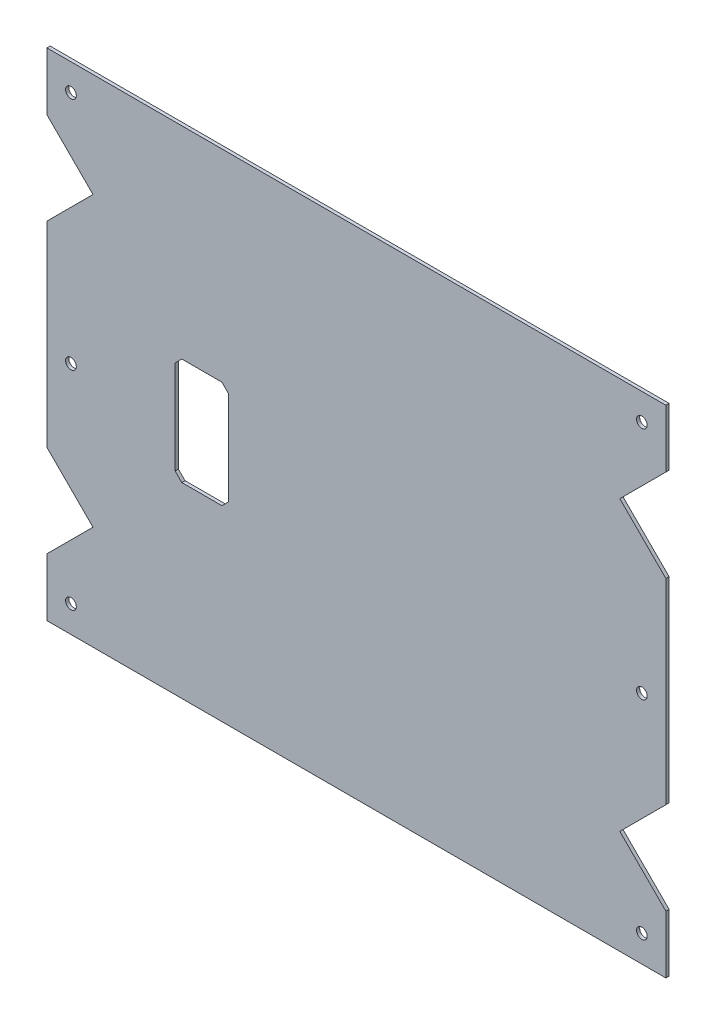
ISO-10303-21;
HEADER;
FILE_DESCRIPTION(('STEP AP214'),'2;1');
FILE_NAME('part.step','',(''),(''),'','','');
FILE_SCHEMA(('AUTOMOTIVE_DESIGN { 1 0 10303 214 1 1 1 1 }'));
ENDSEC;
DATA;
#1=APPLICATION_CONTEXT('core data for automotive mechanical design processes');
#2=APPLICATION_PROTOCOL_DEFINITION('international standard','automotive_design',2000,#1);
#3=PRODUCT_CONTEXT('',#1,'mechanical');
#4=PRODUCT('Part','Part','',(#3));
#5=PRODUCT_RELATED_PRODUCT_CATEGORY('part','',(#4));
#6=PRODUCT_DEFINITION_FORMATION('','',#4);
#7=PRODUCT_DEFINITION_CONTEXT('part definition',#1,'design');
#8=PRODUCT_DEFINITION('design','',#6,#7);
#9=PRODUCT_DEFINITION_SHAPE('','',#8);
#10=(LENGTH_UNIT() NAMED_UNIT(*) SI_UNIT(.MILLI.,.METRE.));
#11=(NAMED_UNIT(*) PLANE_ANGLE_UNIT() SI_UNIT($,.RADIAN.));
#12=(NAMED_UNIT(*) SI_UNIT($,.STERADIAN.) SOLID_ANGLE_UNIT());
#13=UNCERTAINTY_MEASURE_WITH_UNIT(LENGTH_MEASURE(1.E-05),#10,'distance_accuracy_value','');
#14=(GEOMETRIC_REPRESENTATION_CONTEXT(3) GLOBAL_UNCERTAINTY_ASSIGNED_CONTEXT((#13)) GLOBAL_UNIT_ASSIGNED_CONTEXT((#10,
#11,#12)) REPRESENTATION_CONTEXT('',''));
#15=CARTESIAN_POINT('',(0.,0.,0.));
#16=DIRECTION('',(0.,0.,1.));
#17=DIRECTION('',(1.,0.,0.));
#18=AXIS2_PLACEMENT_3D('',#15,#16,#17);
#19=CARTESIAN_POINT('',(0.,0.,-1.2));
#20=DIRECTION('',(0.,0.,1.));
#21=DIRECTION('',(1.,0.,0.));
#22=AXIS2_PLACEMENT_3D('',#19,#20,#21);
#23=PLANE('',#22);
#24=DIRECTION('',(0.707106781186546,0.707106781186549,0.));
#25=VECTOR('',#24,1.);
#26=CARTESIAN_POINT('',(-125.097205420987,27.3232233047034,-1.19999999999985));
#27=LINE('',#26,#25);
#28=CARTESIAN_POINT('',(-115.773982116284,36.6464466094066,-1.19999999999991));
#29=VERTEX_POINT('',#28);
#30=CARTESIAN_POINT('',(-98.5334376675488,53.8869910581421,-1.20000000000004));
#31=VERTEX_POINT('',#30);
#32=EDGE_CURVE('E728',#29,#31,#27,.T.);
#33=ORIENTED_EDGE('',*,*,#32,.T.);
#34=DIRECTION('',(-0.707106781186546,0.707106781186549,0.));
#35=VECTOR('',#34,1.);
#36=CARTESIAN_POINT('',(-125.097205420987,80.4507588115805,-1.19999999999966));
#37=LINE('',#36,#35);
#38=CARTESIAN_POINT('',(-115.773982116284,71.1275355068775,-1.19999999999978));
#39=VERTEX_POINT('',#38);
#40=EDGE_CURVE('E764',#31,#39,#37,.T.);
#41=ORIENTED_EDGE('',*,*,#40,.T.);
#42=DIRECTION('',(0.,1.,0.));
#43=VECTOR('',#42,1.);
#44=CARTESIAN_POINT('',(-115.773982116284,54.9739821162841,-1.19999999999989));
#45=LINE('',#44,#43);
#46=CARTESIAN_POINT('',(-115.773982116284,92.7739821162842,-1.19999999999963));
#47=VERTEX_POINT('',#46);
#48=EDGE_CURVE('E779',#47,#39,#45,.F.);
#49=ORIENTED_EDGE('',*,*,#48,.F.);
#50=DIRECTION('',(1.,0.,0.));
#51=VECTOR('',#50,1.);
#52=CARTESIAN_POINT('',(98.9739821162842,92.7739821162842,-1.19999999999974));
#53=LINE('',#52,#51);
#54=CARTESIAN_POINT('',(115.773982116284,92.7739821162842,-1.19999999999961));
#55=VERTEX_POINT('',#54);
#56=EDGE_CURVE('E800',#55,#47,#53,.F.);
#57=ORIENTED_EDGE('',*,*,#56,.F.);
#58=DIRECTION('',(0.,-1.,0.));
#59=VECTOR('',#58,1.);
#60=CARTESIAN_POINT('',(115.773982116284,92.7739821162842,-1.19999999999961));
#61=LINE('',#60,#59);
#62=CARTESIAN_POINT('',(115.773982116284,71.1275355068775,-1.19999999999977));
#63=VERTEX_POINT('',#62);
#64=EDGE_CURVE('E793',#63,#55,#61,.F.);
#65=ORIENTED_EDGE('',*,*,#64,.F.);
#66=DIRECTION('',(-0.707106781186546,-0.707106781186549,0.));
#67=VECTOR('',#66,1.);
#68=CARTESIAN_POINT('',(125.097205420987,80.4507588115805,-1.19999999999964));
#69=LINE('',#68,#67);
#70=CARTESIAN_POINT('',(98.5334376675488,53.886991058142,-1.20000000000001));
#71=VERTEX_POINT('',#70);
#72=EDGE_CURVE('E768',#63,#71,#69,.T.);
#73=ORIENTED_EDGE('',*,*,#72,.T.);
#74=DIRECTION('',(0.707106781186547,-0.707106781186548,0.));
#75=VECTOR('',#74,1.);
#76=CARTESIAN_POINT('',(125.097205420987,27.3232233047034,-1.19999999999984));
#77=LINE('',#76,#75);
#78=CARTESIAN_POINT('',(115.773982116284,36.6464466094067,-1.19999999999991));
#79=VERTEX_POINT('',#78);
#80=EDGE_CURVE('E894',#71,#79,#77,.T.);
#81=ORIENTED_EDGE('',*,*,#80,.T.);
#82=DIRECTION('',(0.,-1.,0.));
#83=VECTOR('',#82,1.);
#84=CARTESIAN_POINT('',(115.773982116284,52.8,-1.1999999999999));
#85=LINE('',#84,#83);
#86=CARTESIAN_POINT('',(115.773982116284,-36.6464466094067,-1.19999999999991));
#87=VERTEX_POINT('',#86);
#88=EDGE_CURVE('E817',#87,#79,#85,.F.);
#89=ORIENTED_EDGE('',*,*,#88,.F.);
#90=DIRECTION('',(-0.707106781186546,-0.707106781186549,0.));
#91=VECTOR('',#90,1.);
#92=CARTESIAN_POINT('',(125.097205420987,-27.3232233047034,-1.19999999999985));
#93=LINE('',#92,#91);
#94=CARTESIAN_POINT('',(98.5334376675488,-53.8869910581421,-1.20000000000004));
#95=VERTEX_POINT('',#94);
#96=EDGE_CURVE('E891',#87,#95,#93,.T.);
#97=ORIENTED_EDGE('',*,*,#96,.T.);
#98=DIRECTION('',(0.707106781186546,-0.707106781186549,0.));
#99=VECTOR('',#98,1.);
#100=CARTESIAN_POINT('',(125.097205420987,-80.4507588115805,-1.19999999999965));
#101=LINE('',#100,#99);
#102=CARTESIAN_POINT('',(115.773982116284,-71.1275355068775,-1.19999999999978));
#103=VERTEX_POINT('',#102);
#104=EDGE_CURVE('E825',#95,#103,#101,.T.);
#105=ORIENTED_EDGE('',*,*,#104,.T.);
#106=DIRECTION('',(0.,-1.,0.));
#107=VECTOR('',#106,1.);
#108=CARTESIAN_POINT('',(115.773982116284,-54.9739821162841,-1.1999999999999));
#109=LINE('',#108,#107);
#110=CARTESIAN_POINT('',(115.773982116284,-92.7739821162842,-1.19999999999962));
#111=VERTEX_POINT('',#110);
#112=EDGE_CURVE('E833',#111,#103,#109,.F.);
#113=ORIENTED_EDGE('',*,*,#112,.F.);
#114=DIRECTION('',(-1.,0.,0.));
#115=VECTOR('',#114,1.);
#116=CARTESIAN_POINT('',(115.773982116284,-92.7739821162842,-1.19999999999962));
#117=LINE('',#116,#115);
#118=CARTESIAN_POINT('',(-115.773982116284,-92.7739821162842,-1.19999999999962));
#119=VERTEX_POINT('',#118);
#120=EDGE_CURVE('E859',#119,#111,#117,.F.);
#121=ORIENTED_EDGE('',*,*,#120,.F.);
#122=DIRECTION('',(0.,1.,0.));
#123=VECTOR('',#122,1.);
#124=CARTESIAN_POINT('',(-115.773982116284,-92.7739821162842,-1.19999999999962));
#125=LINE('',#124,#123);
#126=CARTESIAN_POINT('',(-115.773982116284,-71.1275355068775,-1.19999999999976));
#127=VERTEX_POINT('',#126);
#128=EDGE_CURVE('E851',#127,#119,#125,.F.);
#129=ORIENTED_EDGE('',*,*,#128,.F.);
#130=DIRECTION('',(0.707106781186546,0.707106781186549,0.));
#131=VECTOR('',#130,1.);
#132=CARTESIAN_POINT('',(-125.097205420987,-80.4507588115806,-1.19999999999965));
#133=LINE('',#132,#131);
#134=CARTESIAN_POINT('',(-98.5334376675488,-53.8869910581421,-1.20000000000001));
#135=VERTEX_POINT('',#134);
#136=EDGE_CURVE('E822',#127,#135,#133,.T.);
#137=ORIENTED_EDGE('',*,*,#136,.T.);
#138=DIRECTION('',(-0.707106781186546,0.707106781186549,0.));
#139=VECTOR('',#138,1.);
#140=CARTESIAN_POINT('',(-125.097205420987,-27.3232233047034,-1.19999999999984));
#141=LINE('',#140,#139);
#142=CARTESIAN_POINT('',(-115.773982116284,-36.6464466094067,-1.19999999999991));
#143=VERTEX_POINT('',#142);
#144=EDGE_CURVE('E733',#135,#143,#141,.T.);
#145=ORIENTED_EDGE('',*,*,#144,.T.);
#146=DIRECTION('',(0.,1.,0.));
#147=VECTOR('',#146,1.);
#148=CARTESIAN_POINT('',(-115.773982116284,-52.8,-1.1999999999999));
#149=LINE('',#148,#147);
#150=EDGE_CURVE('E876',#29,#143,#149,.F.);
#151=ORIENTED_EDGE('',*,*,#150,.F.);
#152=EDGE_LOOP('',(#33,#41,#49,#57,#65,#73,#81,#89,#97,#105,#113,#121,#129,#137,#145,#151));
#153=FACE_BOUND('',#152,.T.);
#154=DIRECTION('',(0.,1.,0.));
#155=VECTOR('',#154,1.);
#156=CARTESIAN_POINT('',(-47.8,0.,-1.2));
#157=LINE('',#156,#155);
#158=CARTESIAN_POINT('',(-47.8,-20.3,-1.2));
#159=VERTEX_POINT('',#158);
#160=CARTESIAN_POINT('',(-47.8,14.7,-1.2));
#161=VERTEX_POINT('',#160);
#162=EDGE_CURVE('E552',#159,#161,#157,.T.);
#163=ORIENTED_EDGE('',*,*,#162,.T.);
#164=DIRECTION('',(-0.707106781186548,0.707106781186547,0.));
#165=VECTOR('',#164,1.);
#166=CARTESIAN_POINT('',(-16.55,-16.55,-1.2));
#167=LINE('',#166,#165);
#168=CARTESIAN_POINT('',(-50.3,17.2,-1.2));
#169=VERTEX_POINT('',#168);
#170=EDGE_CURVE('E13',#161,#169,#167,.T.);
#171=ORIENTED_EDGE('',*,*,#170,.T.);
#172=DIRECTION('',(-1.,0.,0.));
#173=VECTOR('',#172,1.);
#174=CARTESIAN_POINT('',(0.,17.2,-1.2));
#175=LINE('',#174,#173);
#176=CARTESIAN_POINT('',(-65.3,17.2,-1.2));
#177=VERTEX_POINT('',#176);
#178=EDGE_CURVE('E968',#169,#177,#175,.T.);
#179=ORIENTED_EDGE('',*,*,#178,.T.);
#180=DIRECTION('',(-0.707106781186548,-0.707106781186548,0.));
#181=VECTOR('',#180,1.);
#182=CARTESIAN_POINT('',(-41.25,41.25,-1.2));
#183=LINE('',#182,#181);
#184=CARTESIAN_POINT('',(-67.8,14.7,-1.2));
#185=VERTEX_POINT('',#184);
#186=EDGE_CURVE('E991',#177,#185,#183,.T.);
#187=ORIENTED_EDGE('',*,*,#186,.T.);
#188=DIRECTION('',(0.,-1.,0.));
#189=VECTOR('',#188,1.);
#190=CARTESIAN_POINT('',(-67.8,0.,-1.2));
#191=LINE('',#190,#189);
#192=CARTESIAN_POINT('',(-67.8,-20.3,-1.2));
#193=VERTEX_POINT('',#192);
#194=EDGE_CURVE('E995',#185,#193,#191,.T.);
#195=ORIENTED_EDGE('',*,*,#194,.T.);
#196=DIRECTION('',(0.707106781186548,-0.707106781186547,0.));
#197=VECTOR('',#196,1.);
#198=CARTESIAN_POINT('',(-44.05,-44.05,-1.2));
#199=LINE('',#198,#197);
#200=CARTESIAN_POINT('',(-65.3,-22.8,-1.2));
#201=VERTEX_POINT('',#200);
#202=EDGE_CURVE('E999',#193,#201,#199,.T.);
#203=ORIENTED_EDGE('',*,*,#202,.T.);
#204=DIRECTION('',(1.,0.,0.));
#205=VECTOR('',#204,1.);
#206=CARTESIAN_POINT('',(0.,-22.8,-1.2));
#207=LINE('',#206,#205);
#208=CARTESIAN_POINT('',(-50.3,-22.8,-1.2));
#209=VERTEX_POINT('',#208);
#210=EDGE_CURVE('E1003',#201,#209,#207,.T.);
#211=ORIENTED_EDGE('',*,*,#210,.T.);
#212=DIRECTION('',(0.707106781186548,0.707106781186547,0.));
#213=VECTOR('',#212,1.);
#214=CARTESIAN_POINT('',(-13.75,13.75,-1.2));
#215=LINE('',#214,#213);
#216=EDGE_CURVE('E1007',#209,#159,#215,.T.);
#217=ORIENTED_EDGE('',*,*,#216,.T.);
#218=EDGE_LOOP('',(#163,#171,#179,#187,#195,#203,#211,#217));
#219=FACE_BOUND('',#218,.T.);
#220=CARTESIAN_POINT('',(-106.773982116285,-5.00000000000013,-1.19999999999998));
#221=DIRECTION('',(0.,0.,-1.));
#222=DIRECTION('',(-1.,0.,0.));
#223=AXIS2_PLACEMENT_3D('',#220,#221,#222);
#224=CIRCLE('',#223,2.);
#225=CARTESIAN_POINT('',(-108.773982116285,-5.00000000000013,-1.19999999999997));
#226=VERTEX_POINT('',#225);
#227=EDGE_CURVE('E928',#226,#226,#224,.T.);
#228=ORIENTED_EDGE('',*,*,#227,.F.);
#229=EDGE_LOOP('',(#228));
#230=FACE_BOUND('',#229,.T.);
#231=CARTESIAN_POINT('',(106.773982116284,-5.00000000000013,-1.19999999999998));
#232=DIRECTION('',(0.,0.,-1.));
#233=DIRECTION('',(-1.,0.,0.));
#234=AXIS2_PLACEMENT_3D('',#231,#232,#233);
#235=CIRCLE('',#234,2.);
#236=CARTESIAN_POINT('',(104.773982116284,-5.00000000000013,-1.19999999999999));
#237=VERTEX_POINT('',#236);
#238=EDGE_CURVE('E902',#237,#237,#235,.T.);
#239=ORIENTED_EDGE('',*,*,#238,.F.);
#240=EDGE_LOOP('',(#239));
#241=FACE_BOUND('',#240,.T.);
#242=CARTESIAN_POINT('',(-106.773982116284,-82.7739821162848,-1.19999999999975));
#243=DIRECTION('',(0.,0.,-1.));
#244=DIRECTION('',(-1.,0.,0.));
#245=AXIS2_PLACEMENT_3D('',#242,#243,#244);
#246=CIRCLE('',#245,2.);
#247=CARTESIAN_POINT('',(-108.773982116284,-82.7739821162847,-1.19999999999974));
#248=VERTEX_POINT('',#247);
#249=EDGE_CURVE('E862',#248,#248,#246,.T.);
#250=ORIENTED_EDGE('',*,*,#249,.F.);
#251=EDGE_LOOP('',(#250));
#252=FACE_BOUND('',#251,.T.);
#253=CARTESIAN_POINT('',(106.773982116284,-82.7739821162841,-1.19999999999978));
#254=DIRECTION('',(0.,0.,-1.));
#255=DIRECTION('',(-1.,0.,0.));
#256=AXIS2_PLACEMENT_3D('',#253,#254,#255);
#257=CIRCLE('',#256,2.);
#258=CARTESIAN_POINT('',(104.773982116284,-82.7739821162841,-1.1999999999998));
#259=VERTEX_POINT('',#258);
#260=EDGE_CURVE('E753',#259,#259,#257,.T.);
#261=ORIENTED_EDGE('',*,*,#260,.F.);
#262=EDGE_LOOP('',(#261));
#263=FACE_BOUND('',#262,.T.);
#264=CARTESIAN_POINT('',(-106.773982116284,82.7739821162848,-1.19999999999976));
#265=DIRECTION('',(0.,0.,-1.));
#266=DIRECTION('',(1.,0.,0.));
#267=AXIS2_PLACEMENT_3D('',#264,#265,#266);
#268=CIRCLE('',#267,2.);
#269=CARTESIAN_POINT('',(-104.773982116284,82.7739821162848,-1.19999999999978));
#270=VERTEX_POINT('',#269);
#271=EDGE_CURVE('E796',#270,#270,#268,.T.);
#272=ORIENTED_EDGE('',*,*,#271,.F.);
#273=EDGE_LOOP('',(#272));
#274=FACE_BOUND('',#273,.T.);
#275=CARTESIAN_POINT('',(106.773982116284,82.7739821162842,-1.19999999999974));
#276=DIRECTION('',(0.,0.,-1.));
#277=DIRECTION('',(1.,0.,0.));
#278=AXIS2_PLACEMENT_3D('',#275,#276,#277);
#279=CIRCLE('',#278,2.);
#280=CARTESIAN_POINT('',(108.773982116284,82.7739821162842,-1.19999999999973));
#281=VERTEX_POINT('',#280);
#282=EDGE_CURVE('E749',#281,#281,#279,.T.);
#283=ORIENTED_EDGE('',*,*,#282,.F.);
#284=EDGE_LOOP('',(#283));
#285=FACE_BOUND('',#284,.T.);
#286=ADVANCED_FACE('F543',(#153,#219,#230,#241,#252,#263,#274,#285),#23,.F.);
#287=CARTESIAN_POINT('',(0.,0.,0.));
#288=DIRECTION('',(0.,0.,1.));
#289=DIRECTION('',(1.,0.,0.));
#290=AXIS2_PLACEMENT_3D('',#287,#288,#289);
#291=PLANE('',#290);
#292=DIRECTION('',(-0.707106781186546,0.707106781186549,0.));
#293=VECTOR('',#292,1.);
#294=CARTESIAN_POINT('',(-99.9739821162841,55.3275355068774,0.));
#295=LINE('',#294,#293);
#296=CARTESIAN_POINT('',(-98.5334376675488,53.8869910581421,0.));
#297=VERTEX_POINT('',#296);
#298=CARTESIAN_POINT('',(-115.773982116284,71.1275355068775,2.28983498828939E-13));
#299=VERTEX_POINT('',#298);
#300=EDGE_CURVE('E754',#297,#299,#295,.T.);
#301=ORIENTED_EDGE('',*,*,#300,.F.);
#302=DIRECTION('',(0.707106781186546,0.707106781186549,0.));
#303=VECTOR('',#302,1.);
#304=CARTESIAN_POINT('',(-174.98597798299,-22.5655492572994,4.44089209850063E-13));
#305=LINE('',#304,#303);
#306=CARTESIAN_POINT('',(-115.773982116284,36.6464466094066,0.));
#307=VERTEX_POINT('',#306);
#308=EDGE_CURVE('E909',#307,#297,#305,.T.);
#309=ORIENTED_EDGE('',*,*,#308,.F.);
#310=DIRECTION('',(0.,-1.,0.));
#311=VECTOR('',#310,1.);
#312=CARTESIAN_POINT('',(-115.773982116284,0.,0.));
#313=LINE('',#312,#311);
#314=CARTESIAN_POINT('',(-115.773982116284,-36.6464466094067,1.11022302462516E-13));
#315=VERTEX_POINT('',#314);
#316=EDGE_CURVE('E723',#307,#315,#313,.T.);
#317=ORIENTED_EDGE('',*,*,#316,.T.);
#318=DIRECTION('',(-0.707106781186546,0.707106781186549,0.));
#319=VECTOR('',#318,1.);
#320=CARTESIAN_POINT('',(-99.9739821162841,-52.4464466094067,0.));
#321=LINE('',#320,#319);
#322=CARTESIAN_POINT('',(-98.5334376675488,-53.8869910581421,0.));
#323=VERTEX_POINT('',#322);
#324=EDGE_CURVE('E719',#323,#315,#321,.T.);
#325=ORIENTED_EDGE('',*,*,#324,.F.);
#326=DIRECTION('',(0.707106781186546,0.707106781186549,0.));
#327=VECTOR('',#326,1.);
#328=CARTESIAN_POINT('',(-128.725646100053,-84.0791994906468,4.16333634234434E-13));
#329=LINE('',#328,#327);
#330=CARTESIAN_POINT('',(-115.773982116284,-71.1275355068775,2.42861286636753E-13));
#331=VERTEX_POINT('',#330);
#332=EDGE_CURVE('E706',#331,#323,#329,.T.);
#333=ORIENTED_EDGE('',*,*,#332,.F.);
#334=DIRECTION('',(0.,-1.,0.));
#335=VECTOR('',#334,1.);
#336=CARTESIAN_POINT('',(-115.773982116284,-52.773982116284,1.11022302462516E-13));
#337=LINE('',#336,#335);
#338=CARTESIAN_POINT('',(-115.773982116284,-92.7739821162842,3.88578058618805E-13));
#339=VERTEX_POINT('',#338);
#340=EDGE_CURVE('E844',#331,#339,#337,.T.);
#341=ORIENTED_EDGE('',*,*,#340,.T.);
#342=DIRECTION('',(1.,0.,0.));
#343=VECTOR('',#342,1.);
#344=CARTESIAN_POINT('',(-152.773982116284,-92.7739821162842,6.38378239159465E-13));
#345=LINE('',#344,#343);
#346=CARTESIAN_POINT('',(115.773982116284,-92.7739821162842,3.81639164714898E-13));
#347=VERTEX_POINT('',#346);
#348=EDGE_CURVE('E841',#339,#347,#345,.T.);
#349=ORIENTED_EDGE('',*,*,#348,.T.);
#350=DIRECTION('',(0.,1.,0.));
#351=VECTOR('',#350,1.);
#352=CARTESIAN_POINT('',(115.773982116284,-52.7739821162839,0.));
#353=LINE('',#352,#351);
#354=CARTESIAN_POINT('',(115.773982116284,-71.1275355068775,2.22044604925031E-13));
#355=VERTEX_POINT('',#354);
#356=EDGE_CURVE('E829',#347,#355,#353,.T.);
#357=ORIENTED_EDGE('',*,*,#356,.T.);
#358=DIRECTION('',(0.707106781186546,-0.707106781186549,0.));
#359=VECTOR('',#358,1.);
#360=CARTESIAN_POINT('',(99.9739821162841,-55.3275355068774,0.));
#361=LINE('',#360,#359);
#362=CARTESIAN_POINT('',(98.5334376675488,-53.8869910581421,0.));
#363=VERTEX_POINT('',#362);
#364=EDGE_CURVE('E716',#363,#355,#361,.T.);
#365=ORIENTED_EDGE('',*,*,#364,.F.);
#366=DIRECTION('',(-0.707106781186546,-0.707106781186549,0.));
#367=VECTOR('',#366,1.);
#368=CARTESIAN_POINT('',(174.98597798299,22.5655492572994,4.44089209850063E-13));
#369=LINE('',#368,#367);
#370=CARTESIAN_POINT('',(115.773982116284,-36.6464466094067,0.));
#371=VERTEX_POINT('',#370);
#372=EDGE_CURVE('E873',#371,#363,#369,.T.);
#373=ORIENTED_EDGE('',*,*,#372,.F.);
#374=DIRECTION('',(0.,1.,0.));
#375=VECTOR('',#374,1.);
#376=CARTESIAN_POINT('',(115.773982116284,0.,0.));
#377=LINE('',#376,#375);
#378=CARTESIAN_POINT('',(115.773982116284,36.6464466094067,1.11022302462516E-13));
#379=VERTEX_POINT('',#378);
#380=EDGE_CURVE('E881',#371,#379,#377,.T.);
#381=ORIENTED_EDGE('',*,*,#380,.T.);
#382=DIRECTION('',(0.707106781186546,-0.707106781186548,0.));
#383=VECTOR('',#382,1.);
#384=CARTESIAN_POINT('',(99.9739821162841,52.4464466094067,0.));
#385=LINE('',#384,#383);
#386=CARTESIAN_POINT('',(98.5334376675488,53.886991058142,0.));
#387=VERTEX_POINT('',#386);
#388=EDGE_CURVE('E888',#387,#379,#385,.T.);
#389=ORIENTED_EDGE('',*,*,#388,.F.);
#390=DIRECTION('',(-0.707106781186546,-0.707106781186549,0.));
#391=VECTOR('',#390,1.);
#392=CARTESIAN_POINT('',(128.725646100053,84.0791994906468,4.09394740330526E-13));
#393=LINE('',#392,#391);
#394=CARTESIAN_POINT('',(115.773982116284,71.1275355068775,2.35922392732846E-13));
#395=VERTEX_POINT('',#394);
#396=EDGE_CURVE('E757',#395,#387,#393,.T.);
#397=ORIENTED_EDGE('',*,*,#396,.F.);
#398=DIRECTION('',(0.,1.,0.));
#399=VECTOR('',#398,1.);
#400=CARTESIAN_POINT('',(115.773982116284,52.7739821162839,1.04083408558608E-13));
#401=LINE('',#400,#399);
#402=CARTESIAN_POINT('',(115.773982116284,92.7739821162842,3.95516952522712E-13));
#403=VERTEX_POINT('',#402);
#404=EDGE_CURVE('E790',#395,#403,#401,.T.);
#405=ORIENTED_EDGE('',*,*,#404,.T.);
#406=DIRECTION('',(-1.,0.,0.));
#407=VECTOR('',#406,1.);
#408=CARTESIAN_POINT('',(152.773982116284,92.7739821162842,6.45317133063372E-13));
#409=LINE('',#408,#407);
#410=CARTESIAN_POINT('',(-115.773982116284,92.7739821162842,3.7470027081099E-13));
#411=VERTEX_POINT('',#410);
#412=EDGE_CURVE('E787',#403,#411,#409,.T.);
#413=ORIENTED_EDGE('',*,*,#412,.T.);
#414=DIRECTION('',(0.,-1.,0.));
#415=VECTOR('',#414,1.);
#416=CARTESIAN_POINT('',(-115.773982116284,52.773982116284,0.));
#417=LINE('',#416,#415);
#418=EDGE_CURVE('E771',#411,#299,#417,.T.);
#419=ORIENTED_EDGE('',*,*,#418,.T.);
#420=EDGE_LOOP('',(#301,#309,#317,#325,#333,#341,#349,#357,#365,#373,#381,#389,#397,#405,#413,#419));
#421=FACE_BOUND('',#420,.T.);
#422=DIRECTION('',(-0.707106781186548,0.707106781186547,0.));
#423=VECTOR('',#422,1.);
#424=CARTESIAN_POINT('',(-47.8,14.7,0.));
#425=LINE('',#424,#423);
#426=CARTESIAN_POINT('',(-47.8,14.7,0.));
#427=VERTEX_POINT('',#426);
#428=CARTESIAN_POINT('',(-50.3,17.2,0.));
#429=VERTEX_POINT('',#428);
#430=EDGE_CURVE('E567',#427,#429,#425,.T.);
#431=ORIENTED_EDGE('',*,*,#430,.F.);
#432=DIRECTION('',(0.,1.,0.));
#433=VECTOR('',#432,1.);
#434=CARTESIAN_POINT('',(-47.8,-20.3,0.));
#435=LINE('',#434,#433);
#436=CARTESIAN_POINT('',(-47.8,-20.3,0.));
#437=VERTEX_POINT('',#436);
#438=EDGE_CURVE('E960',#437,#427,#435,.T.);
#439=ORIENTED_EDGE('',*,*,#438,.F.);
#440=DIRECTION('',(0.707106781186548,0.707106781186547,0.));
#441=VECTOR('',#440,1.);
#442=CARTESIAN_POINT('',(-47.8,-20.3,0.));
#443=LINE('',#442,#441);
#444=CARTESIAN_POINT('',(-50.3,-22.8,0.));
#445=VERTEX_POINT('',#444);
#446=EDGE_CURVE('E956',#445,#437,#443,.T.);
#447=ORIENTED_EDGE('',*,*,#446,.F.);
#448=DIRECTION('',(1.,0.,0.));
#449=VECTOR('',#448,1.);
#450=CARTESIAN_POINT('',(-50.3,-22.8,0.));
#451=LINE('',#450,#449);
#452=CARTESIAN_POINT('',(-65.3,-22.8,0.));
#453=VERTEX_POINT('',#452);
#454=EDGE_CURVE('E952',#453,#445,#451,.T.);
#455=ORIENTED_EDGE('',*,*,#454,.F.);
#456=DIRECTION('',(0.707106781186548,-0.707106781186547,0.));
#457=VECTOR('',#456,1.);
#458=CARTESIAN_POINT('',(-65.3,-22.8,0.));
#459=LINE('',#458,#457);
#460=CARTESIAN_POINT('',(-67.8,-20.3,0.));
#461=VERTEX_POINT('',#460);
#462=EDGE_CURVE('E948',#461,#453,#459,.T.);
#463=ORIENTED_EDGE('',*,*,#462,.F.);
#464=DIRECTION('',(0.,-1.,0.));
#465=VECTOR('',#464,1.);
#466=CARTESIAN_POINT('',(-67.8,-20.3,0.));
#467=LINE('',#466,#465);
#468=CARTESIAN_POINT('',(-67.8,14.7,0.));
#469=VERTEX_POINT('',#468);
#470=EDGE_CURVE('E944',#469,#461,#467,.T.);
#471=ORIENTED_EDGE('',*,*,#470,.F.);
#472=DIRECTION('',(-0.707106781186547,-0.707106781186547,0.));
#473=VECTOR('',#472,1.);
#474=CARTESIAN_POINT('',(-65.3,17.2,0.));
#475=LINE('',#474,#473);
#476=CARTESIAN_POINT('',(-65.3,17.2,0.));
#477=VERTEX_POINT('',#476);
#478=EDGE_CURVE('E940',#477,#469,#475,.T.);
#479=ORIENTED_EDGE('',*,*,#478,.F.);
#480=DIRECTION('',(-1.,0.,0.));
#481=VECTOR('',#480,1.);
#482=CARTESIAN_POINT('',(-50.3,17.2,0.));
#483=LINE('',#482,#481);
#484=EDGE_CURVE('E937',#429,#477,#483,.T.);
#485=ORIENTED_EDGE('',*,*,#484,.F.);
#486=EDGE_LOOP('',(#431,#439,#447,#455,#463,#471,#479,#485));
#487=FACE_BOUND('',#486,.T.);
#488=CARTESIAN_POINT('',(-106.773982116285,-5.00000000000013,0.));
#489=DIRECTION('',(0.,0.,-1.));
#490=DIRECTION('',(-1.,0.,0.));
#491=AXIS2_PLACEMENT_3D('',#488,#489,#490);
#492=CIRCLE('',#491,2.);
#493=CARTESIAN_POINT('',(-108.773982116285,-5.00000000000013,0.));
#494=VERTEX_POINT('',#493);
#495=EDGE_CURVE('E918',#494,#494,#492,.T.);
#496=ORIENTED_EDGE('',*,*,#495,.T.);
#497=EDGE_LOOP('',(#496));
#498=FACE_BOUND('',#497,.T.);
#499=CARTESIAN_POINT('',(106.773982116284,-5.00000000000013,0.));
#500=DIRECTION('',(0.,0.,1.));
#501=DIRECTION('',(1.,0.,0.));
#502=AXIS2_PLACEMENT_3D('',#499,#500,#501);
#503=CIRCLE('',#502,2.);
#504=CARTESIAN_POINT('',(108.773982116284,-5.00000000000013,0.));
#505=VERTEX_POINT('',#504);
#506=EDGE_CURVE('E898',#505,#505,#503,.T.);
#507=ORIENTED_EDGE('',*,*,#506,.F.);
#508=EDGE_LOOP('',(#507));
#509=FACE_BOUND('',#508,.T.);
#510=CARTESIAN_POINT('',(106.773982116284,-82.7739821162841,3.05311331771918E-13));
#511=DIRECTION('',(0.,0.,1.));
#512=DIRECTION('',(0.,-1.,0.));
#513=AXIS2_PLACEMENT_3D('',#510,#511,#512);
#514=CIRCLE('',#513,2.);
#515=CARTESIAN_POINT('',(106.773982116284,-84.7739821162841,3.25267009139518E-13));
#516=VERTEX_POINT('',#515);
#517=EDGE_CURVE('E866',#516,#516,#514,.T.);
#518=ORIENTED_EDGE('',*,*,#517,.F.);
#519=EDGE_LOOP('',(#518));
#520=FACE_BOUND('',#519,.T.);
#521=CARTESIAN_POINT('',(-106.773982116284,-82.7739821162848,2.56739074444567E-13));
#522=DIRECTION('',(0.,0.,-1.));
#523=DIRECTION('',(-1.,0.,0.));
#524=AXIS2_PLACEMENT_3D('',#521,#522,#523);
#525=CIRCLE('',#524,2.);
#526=CARTESIAN_POINT('',(-108.773982116284,-82.7739821162847,2.70330507506927E-13));
#527=VERTEX_POINT('',#526);
#528=EDGE_CURVE('E847',#527,#527,#525,.T.);
#529=ORIENTED_EDGE('',*,*,#528,.T.);
#530=EDGE_LOOP('',(#529));
#531=FACE_BOUND('',#530,.T.);
#532=CARTESIAN_POINT('',(-106.773982116284,82.7739821162848,2.42861286636753E-13));
#533=DIRECTION('',(0.,0.,-1.));
#534=DIRECTION('',(1.,0.,0.));
#535=AXIS2_PLACEMENT_3D('',#532,#533,#534);
#536=CIRCLE('',#535,2.);
#537=CARTESIAN_POINT('',(-104.773982116284,82.7739821162848,2.29269853574393E-13));
#538=VERTEX_POINT('',#537);
#539=EDGE_CURVE('E775',#538,#538,#536,.T.);
#540=ORIENTED_EDGE('',*,*,#539,.T.);
#541=EDGE_LOOP('',(#540));
#542=FACE_BOUND('',#541,.T.);
#543=CARTESIAN_POINT('',(106.773982116284,82.7739821162842,3.19189119579733E-13));
#544=DIRECTION('',(0.,0.,1.));
#545=DIRECTION('',(0.,1.,0.));
#546=AXIS2_PLACEMENT_3D('',#543,#544,#545);
#547=CIRCLE('',#546,2.);
#548=CARTESIAN_POINT('',(106.773982116284,84.7739821162842,3.39144796947332E-13));
#549=VERTEX_POINT('',#548);
#550=EDGE_CURVE('E807',#549,#549,#547,.T.);
#551=ORIENTED_EDGE('',*,*,#550,.F.);
#552=EDGE_LOOP('',(#551));
#553=FACE_BOUND('',#552,.T.);
#554=ADVANCED_FACE('F545',(#421,#487,#498,#509,#520,#531,#542,#553),#291,.T.);
#555=CARTESIAN_POINT('',(-47.8,14.7,-10.));
#556=DIRECTION('',(0.707106781186547,0.707106781186548,0.));
#557=DIRECTION('',(-0.707106781186548,0.707106781186547,0.));
#558=AXIS2_PLACEMENT_3D('',#555,#556,#557);
#559=PLANE('',#558);
#560=DIRECTION('',(0.,0.,1.));
#561=VECTOR('',#560,1.);
#562=CARTESIAN_POINT('',(-47.8,14.7,-10.));
#563=LINE('',#562,#561);
#564=EDGE_CURVE('E965',#161,#427,#563,.T.);
#565=ORIENTED_EDGE('',*,*,#564,.T.);
#566=ORIENTED_EDGE('',*,*,#430,.T.);
#567=DIRECTION('',(0.,0.,1.));
#568=VECTOR('',#567,1.);
#569=CARTESIAN_POINT('',(-50.3,17.2,-10.));
#570=LINE('',#569,#568);
#571=EDGE_CURVE('E964',#169,#429,#570,.T.);
#572=ORIENTED_EDGE('',*,*,#571,.F.);
#573=ORIENTED_EDGE('',*,*,#170,.F.);
#574=EDGE_LOOP('',(#565,#566,#572,#573));
#575=FACE_BOUND('',#574,.T.);
#576=ADVANCED_FACE('F1029',(#575),#559,.F.);
#577=CARTESIAN_POINT('',(-47.8,-20.3,-10.));
#578=DIRECTION('',(1.,0.,0.));
#579=DIRECTION('',(0.,0.,-1.));
#580=AXIS2_PLACEMENT_3D('',#577,#578,#579);
#581=PLANE('',#580);
#582=DIRECTION('',(0.,0.,1.));
#583=VECTOR('',#582,1.);
#584=CARTESIAN_POINT('',(-47.8,-20.3,-10.));
#585=LINE('',#584,#583);
#586=EDGE_CURVE('E969',#159,#437,#585,.T.);
#587=ORIENTED_EDGE('',*,*,#586,.T.);
#588=ORIENTED_EDGE('',*,*,#438,.T.);
#589=ORIENTED_EDGE('',*,*,#564,.F.);
#590=ORIENTED_EDGE('',*,*,#162,.F.);
#591=EDGE_LOOP('',(#587,#588,#589,#590));
#592=FACE_BOUND('',#591,.T.);
#593=ADVANCED_FACE('F1017',(#592),#581,.F.);
#594=CARTESIAN_POINT('',(-47.8,-20.3,-10.));
#595=DIRECTION('',(0.707106781186547,-0.707106781186548,0.));
#596=DIRECTION('',(0.707106781186548,0.707106781186547,0.));
#597=AXIS2_PLACEMENT_3D('',#594,#595,#596);
#598=PLANE('',#597);
#599=DIRECTION('',(0.,0.,1.));
#600=VECTOR('',#599,1.);
#601=CARTESIAN_POINT('',(-50.3,-22.8,-10.));
#602=LINE('',#601,#600);
#603=EDGE_CURVE('E972',#209,#445,#602,.T.);
#604=ORIENTED_EDGE('',*,*,#603,.T.);
#605=ORIENTED_EDGE('',*,*,#446,.T.);
#606=ORIENTED_EDGE('',*,*,#586,.F.);
#607=ORIENTED_EDGE('',*,*,#216,.F.);
#608=EDGE_LOOP('',(#604,#605,#606,#607));
#609=FACE_BOUND('',#608,.T.);
#610=ADVANCED_FACE('F1019',(#609),#598,.F.);
#611=CARTESIAN_POINT('',(-50.3,-22.8,-10.));
#612=DIRECTION('',(0.,-1.,0.));
#613=DIRECTION('',(0.,0.,-1.));
#614=AXIS2_PLACEMENT_3D('',#611,#612,#613);
#615=PLANE('',#614);
#616=DIRECTION('',(0.,0.,1.));
#617=VECTOR('',#616,1.);
#618=CARTESIAN_POINT('',(-65.3,-22.8,-10.));
#619=LINE('',#618,#617);
#620=EDGE_CURVE('E975',#201,#453,#619,.T.);
#621=ORIENTED_EDGE('',*,*,#620,.T.);
#622=ORIENTED_EDGE('',*,*,#454,.T.);
#623=ORIENTED_EDGE('',*,*,#603,.F.);
#624=ORIENTED_EDGE('',*,*,#210,.F.);
#625=EDGE_LOOP('',(#621,#622,#623,#624));
#626=FACE_BOUND('',#625,.T.);
#627=ADVANCED_FACE('F1140',(#626),#615,.F.);
#628=CARTESIAN_POINT('',(-65.3,-22.8,-10.));
#629=DIRECTION('',(-0.707106781186547,-0.707106781186548,0.));
#630=DIRECTION('',(0.707106781186548,-0.707106781186547,0.));
#631=AXIS2_PLACEMENT_3D('',#628,#629,#630);
#632=PLANE('',#631);
#633=DIRECTION('',(0.,0.,1.));
#634=VECTOR('',#633,1.);
#635=CARTESIAN_POINT('',(-67.8,-20.3,-10.));
#636=LINE('',#635,#634);
#637=EDGE_CURVE('E978',#193,#461,#636,.T.);
#638=ORIENTED_EDGE('',*,*,#637,.T.);
#639=ORIENTED_EDGE('',*,*,#462,.T.);
#640=ORIENTED_EDGE('',*,*,#620,.F.);
#641=ORIENTED_EDGE('',*,*,#202,.F.);
#642=EDGE_LOOP('',(#638,#639,#640,#641));
#643=FACE_BOUND('',#642,.T.);
#644=ADVANCED_FACE('F1143',(#643),#632,.F.);
#645=CARTESIAN_POINT('',(-67.8,-20.3,-10.));
#646=DIRECTION('',(-1.,0.,0.));
#647=DIRECTION('',(0.,0.,1.));
#648=AXIS2_PLACEMENT_3D('',#645,#646,#647);
#649=PLANE('',#648);
#650=DIRECTION('',(0.,0.,1.));
#651=VECTOR('',#650,1.);
#652=CARTESIAN_POINT('',(-67.8,14.7,-10.));
#653=LINE('',#652,#651);
#654=EDGE_CURVE('E981',#185,#469,#653,.T.);
#655=ORIENTED_EDGE('',*,*,#654,.T.);
#656=ORIENTED_EDGE('',*,*,#470,.T.);
#657=ORIENTED_EDGE('',*,*,#637,.F.);
#658=ORIENTED_EDGE('',*,*,#194,.F.);
#659=EDGE_LOOP('',(#655,#656,#657,#658));
#660=FACE_BOUND('',#659,.T.);
#661=ADVANCED_FACE('F1147',(#660),#649,.F.);
#662=CARTESIAN_POINT('',(-65.3,17.2,-10.));
#663=DIRECTION('',(-0.707106781186548,0.707106781186548,0.));
#664=DIRECTION('',(-0.707106781186548,-0.707106781186548,0.));
#665=AXIS2_PLACEMENT_3D('',#662,#663,#664);
#666=PLANE('',#665);
#667=DIRECTION('',(0.,0.,1.));
#668=VECTOR('',#667,1.);
#669=CARTESIAN_POINT('',(-65.3,17.2,-10.));
#670=LINE('',#669,#668);
#671=EDGE_CURVE('E559',#177,#477,#670,.T.);
#672=ORIENTED_EDGE('',*,*,#671,.T.);
#673=ORIENTED_EDGE('',*,*,#478,.T.);
#674=ORIENTED_EDGE('',*,*,#654,.F.);
#675=ORIENTED_EDGE('',*,*,#186,.F.);
#676=EDGE_LOOP('',(#672,#673,#674,#675));
#677=FACE_BOUND('',#676,.T.);
#678=ADVANCED_FACE('F1151',(#677),#666,.F.);
#679=CARTESIAN_POINT('',(-50.3,17.2,-10.));
#680=DIRECTION('',(0.,1.,0.));
#681=DIRECTION('',(-1.,0.,0.));
#682=AXIS2_PLACEMENT_3D('',#679,#680,#681);
#683=PLANE('',#682);
#684=ORIENTED_EDGE('',*,*,#571,.T.);
#685=ORIENTED_EDGE('',*,*,#484,.T.);
#686=ORIENTED_EDGE('',*,*,#671,.F.);
#687=ORIENTED_EDGE('',*,*,#178,.F.);
#688=EDGE_LOOP('',(#684,#685,#686,#687));
#689=FACE_BOUND('',#688,.T.);
#690=ADVANCED_FACE('F1028',(#689),#683,.F.);
#691=CARTESIAN_POINT('',(-115.773982116284,-52.8,1.11022302462516E-13));
#692=DIRECTION('',(1.,0.,0.));
#693=DIRECTION('',(0.,0.,-1.));
#694=AXIS2_PLACEMENT_3D('',#691,#692,#693);
#695=PLANE('',#694);
#696=DIRECTION('',(0.,0.,-1.));
#697=VECTOR('',#696,1.);
#698=CARTESIAN_POINT('',(-115.773982116284,-36.6464466094067,1.11022302462516E-13));
#699=LINE('',#698,#697);
#700=EDGE_CURVE('E727',#315,#143,#699,.T.);
#701=ORIENTED_EDGE('',*,*,#700,.F.);
#702=ORIENTED_EDGE('',*,*,#316,.F.);
#703=DIRECTION('',(0.,0.,1.));
#704=VECTOR('',#703,1.);
#705=CARTESIAN_POINT('',(-115.773982116284,36.6464466094066,0.));
#706=LINE('',#705,#704);
#707=EDGE_CURVE('E912',#29,#307,#706,.T.);
#708=ORIENTED_EDGE('',*,*,#707,.F.);
#709=ORIENTED_EDGE('',*,*,#150,.T.);
#710=EDGE_LOOP('',(#701,#702,#708,#709));
#711=FACE_BOUND('',#710,.T.);
#712=ADVANCED_FACE('F1126',(#711),#695,.F.);
#713=CARTESIAN_POINT('',(-106.773982116285,-5.00000000000013,20.));
#714=DIRECTION('',(0.,0.,-1.));
#715=DIRECTION('',(-1.,0.,0.));
#716=AXIS2_PLACEMENT_3D('',#713,#714,#715);
#717=CYLINDRICAL_SURFACE('',#716,2.);
#718=ORIENTED_EDGE('',*,*,#227,.T.);
#719=EDGE_LOOP('',(#718));
#720=FACE_BOUND('',#719,.T.);
#721=ORIENTED_EDGE('',*,*,#495,.F.);
#722=EDGE_LOOP('',(#721));
#723=FACE_BOUND('',#722,.T.);
#724=ADVANCED_FACE('F1129',(#720,#723),#717,.F.);
#725=CARTESIAN_POINT('',(-99.9739821162841,-52.4464466094067,0.));
#726=DIRECTION('',(-0.707106781186549,-0.707106781186546,0.));
#727=DIRECTION('',(-0.707106781186546,0.707106781186549,0.));
#728=AXIS2_PLACEMENT_3D('',#725,#726,#727);
#729=PLANE('',#728);
#730=ORIENTED_EDGE('',*,*,#144,.F.);
#731=DIRECTION('',(0.,0.,-1.));
#732=VECTOR('',#731,1.);
#733=CARTESIAN_POINT('',(-98.5334376675488,-53.8869910581421,0.));
#734=LINE('',#733,#732);
#735=EDGE_CURVE('E711',#323,#135,#734,.T.);
#736=ORIENTED_EDGE('',*,*,#735,.F.);
#737=ORIENTED_EDGE('',*,*,#324,.T.);
#738=ORIENTED_EDGE('',*,*,#700,.T.);
#739=EDGE_LOOP('',(#730,#736,#737,#738));
#740=FACE_BOUND('',#739,.T.);
#741=ADVANCED_FACE('F731',(#740),#729,.T.);
#742=CARTESIAN_POINT('',(-174.98597798299,-22.5655492572994,4.44089209850063E-13));
#743=DIRECTION('',(-0.707106781186549,0.707106781186546,0.));
#744=DIRECTION('',(0.707106781186546,0.707106781186549,0.));
#745=AXIS2_PLACEMENT_3D('',#742,#743,#744);
#746=PLANE('',#745);
#747=ORIENTED_EDGE('',*,*,#32,.F.);
#748=ORIENTED_EDGE('',*,*,#707,.T.);
#749=ORIENTED_EDGE('',*,*,#308,.T.);
#750=DIRECTION('',(0.,0.,-1.));
#751=VECTOR('',#750,1.);
#752=CARTESIAN_POINT('',(-98.5334376675488,53.8869910581421,0.));
#753=LINE('',#752,#751);
#754=EDGE_CURVE('E745',#297,#31,#753,.T.);
#755=ORIENTED_EDGE('',*,*,#754,.T.);
#756=EDGE_LOOP('',(#747,#748,#749,#755));
#757=FACE_BOUND('',#756,.T.);
#758=ADVANCED_FACE('F1051',(#757),#746,.T.);
#759=CARTESIAN_POINT('',(115.773982116284,52.8,0.));
#760=DIRECTION('',(-1.,0.,0.));
#761=DIRECTION('',(0.,0.,1.));
#762=AXIS2_PLACEMENT_3D('',#759,#760,#761);
#763=PLANE('',#762);
#764=DIRECTION('',(0.,0.,-1.));
#765=VECTOR('',#764,1.);
#766=CARTESIAN_POINT('',(115.773982116284,36.6464466094067,0.));
#767=LINE('',#766,#765);
#768=EDGE_CURVE('E885',#379,#79,#767,.T.);
#769=ORIENTED_EDGE('',*,*,#768,.F.);
#770=ORIENTED_EDGE('',*,*,#380,.F.);
#771=DIRECTION('',(0.,0.,1.));
#772=VECTOR('',#771,1.);
#773=CARTESIAN_POINT('',(115.773982116284,-36.6464466094067,0.));
#774=LINE('',#773,#772);
#775=EDGE_CURVE('E877',#87,#371,#774,.T.);
#776=ORIENTED_EDGE('',*,*,#775,.F.);
#777=ORIENTED_EDGE('',*,*,#88,.T.);
#778=EDGE_LOOP('',(#769,#770,#776,#777));
#779=FACE_BOUND('',#778,.T.);
#780=ADVANCED_FACE('F1077',(#779),#763,.F.);
#781=CARTESIAN_POINT('',(106.773982116286,-5.00000000000013,-220.));
#782=DIRECTION('',(0.,0.,1.));
#783=DIRECTION('',(1.,0.,0.));
#784=AXIS2_PLACEMENT_3D('',#781,#782,#783);
#785=CYLINDRICAL_SURFACE('',#784,2.);
#786=ORIENTED_EDGE('',*,*,#238,.T.);
#787=EDGE_LOOP('',(#786));
#788=FACE_BOUND('',#787,.T.);
#789=ORIENTED_EDGE('',*,*,#506,.T.);
#790=EDGE_LOOP('',(#789));
#791=FACE_BOUND('',#790,.T.);
#792=ADVANCED_FACE('F1117',(#788,#791),#785,.F.);
#793=CARTESIAN_POINT('',(99.9739821162841,52.4464466094067,0.));
#794=DIRECTION('',(0.707106781186548,0.707106781186547,0.));
#795=DIRECTION('',(-0.707106781186547,0.707106781186548,0.));
#796=AXIS2_PLACEMENT_3D('',#793,#794,#795);
#797=PLANE('',#796);
#798=ORIENTED_EDGE('',*,*,#80,.F.);
#799=DIRECTION('',(0.,0.,-1.));
#800=VECTOR('',#799,1.);
#801=CARTESIAN_POINT('',(98.5334376675488,53.886991058142,0.));
#802=LINE('',#801,#800);
#803=EDGE_CURVE('E739',#387,#71,#802,.T.);
#804=ORIENTED_EDGE('',*,*,#803,.F.);
#805=ORIENTED_EDGE('',*,*,#388,.T.);
#806=ORIENTED_EDGE('',*,*,#768,.T.);
#807=EDGE_LOOP('',(#798,#804,#805,#806));
#808=FACE_BOUND('',#807,.T.);
#809=ADVANCED_FACE('F1073',(#808),#797,.T.);
#810=CARTESIAN_POINT('',(174.98597798299,22.5655492572994,4.44089209850063E-13));
#811=DIRECTION('',(0.707106781186549,-0.707106781186546,0.));
#812=DIRECTION('',(0.707106781186546,0.707106781186549,0.));
#813=AXIS2_PLACEMENT_3D('',#810,#811,#812);
#814=PLANE('',#813);
#815=ORIENTED_EDGE('',*,*,#96,.F.);
#816=ORIENTED_EDGE('',*,*,#775,.T.);
#817=ORIENTED_EDGE('',*,*,#372,.T.);
#818=DIRECTION('',(0.,0.,-1.));
#819=VECTOR('',#818,1.);
#820=CARTESIAN_POINT('',(98.5334376675488,-53.8869910581421,0.));
#821=LINE('',#820,#819);
#822=EDGE_CURVE('E735',#363,#95,#821,.T.);
#823=ORIENTED_EDGE('',*,*,#822,.T.);
#824=EDGE_LOOP('',(#815,#816,#817,#823));
#825=FACE_BOUND('',#824,.T.);
#826=ADVANCED_FACE('F1082',(#825),#814,.T.);
#827=CARTESIAN_POINT('',(106.773982116285,-82.7739821162863,-220.));
#828=DIRECTION('',(0.,0.,1.));
#829=DIRECTION('',(0.,-1.,0.));
#830=AXIS2_PLACEMENT_3D('',#827,#828,#829);
#831=CYLINDRICAL_SURFACE('',#830,2.);
#832=ORIENTED_EDGE('',*,*,#260,.T.);
#833=EDGE_LOOP('',(#832));
#834=FACE_BOUND('',#833,.T.);
#835=ORIENTED_EDGE('',*,*,#517,.T.);
#836=EDGE_LOOP('',(#835));
#837=FACE_BOUND('',#836,.T.);
#838=ADVANCED_FACE('F1125',(#834,#837),#831,.F.);
#839=CARTESIAN_POINT('',(-106.773982116284,-82.7739821162847,20.0000000000002));
#840=DIRECTION('',(0.,0.,-1.));
#841=DIRECTION('',(0.,-1.,0.));
#842=AXIS2_PLACEMENT_3D('',#839,#840,#841);
#843=CYLINDRICAL_SURFACE('',#842,2.);
#844=ORIENTED_EDGE('',*,*,#249,.T.);
#845=EDGE_LOOP('',(#844));
#846=FACE_BOUND('',#845,.T.);
#847=ORIENTED_EDGE('',*,*,#528,.F.);
#848=EDGE_LOOP('',(#847));
#849=FACE_BOUND('',#848,.T.);
#850=ADVANCED_FACE('F1106',(#846,#849),#843,.F.);
#851=CARTESIAN_POINT('',(115.773982116284,-92.7739821162842,3.81639164714898E-13));
#852=DIRECTION('',(0.,1.,0.));
#853=DIRECTION('',(-1.,0.,0.));
#854=AXIS2_PLACEMENT_3D('',#851,#852,#853);
#855=PLANE('',#854);
#856=DIRECTION('',(0.,0.,-1.));
#857=VECTOR('',#856,1.);
#858=CARTESIAN_POINT('',(115.773982116284,-92.7739821162842,3.81639164714898E-13));
#859=LINE('',#858,#857);
#860=EDGE_CURVE('E837',#347,#111,#859,.T.);
#861=ORIENTED_EDGE('',*,*,#860,.F.);
#862=ORIENTED_EDGE('',*,*,#348,.F.);
#863=DIRECTION('',(0.,0.,-1.));
#864=VECTOR('',#863,1.);
#865=CARTESIAN_POINT('',(-115.773982116284,-92.7739821162842,3.88578058618805E-13));
#866=LINE('',#865,#864);
#867=EDGE_CURVE('E855',#339,#119,#866,.T.);
#868=ORIENTED_EDGE('',*,*,#867,.T.);
#869=ORIENTED_EDGE('',*,*,#120,.T.);
#870=EDGE_LOOP('',(#861,#862,#868,#869));
#871=FACE_BOUND('',#870,.T.);
#872=ADVANCED_FACE('F1095',(#871),#855,.F.);
#873=CARTESIAN_POINT('',(-115.773982116284,-92.7739821162842,3.88578058618805E-13));
#874=DIRECTION('',(1.,0.,0.));
#875=DIRECTION('',(0.,-1.,0.));
#876=AXIS2_PLACEMENT_3D('',#873,#874,#875);
#877=PLANE('',#876);
#878=DIRECTION('',(0.,0.,1.));
#879=VECTOR('',#878,1.);
#880=CARTESIAN_POINT('',(-115.773982116284,-71.1275355068775,2.42861286636753E-13));
#881=LINE('',#880,#879);
#882=EDGE_CURVE('E712',#127,#331,#881,.T.);
#883=ORIENTED_EDGE('',*,*,#882,.F.);
#884=ORIENTED_EDGE('',*,*,#128,.T.);
#885=ORIENTED_EDGE('',*,*,#867,.F.);
#886=ORIENTED_EDGE('',*,*,#340,.F.);
#887=EDGE_LOOP('',(#883,#884,#885,#886));
#888=FACE_BOUND('',#887,.T.);
#889=ADVANCED_FACE('F1098',(#888),#877,.F.);
#890=CARTESIAN_POINT('',(115.773982116284,-54.9739821162841,1.11022302462516E-13));
#891=DIRECTION('',(-1.,0.,0.));
#892=DIRECTION('',(0.,-1.,0.));
#893=AXIS2_PLACEMENT_3D('',#890,#891,#892);
#894=PLANE('',#893);
#895=DIRECTION('',(0.,0.,-1.));
#896=VECTOR('',#895,1.);
#897=CARTESIAN_POINT('',(115.773982116284,-71.1275355068775,2.35922392732846E-13));
#898=LINE('',#897,#896);
#899=EDGE_CURVE('E814',#355,#103,#898,.T.);
#900=ORIENTED_EDGE('',*,*,#899,.F.);
#901=ORIENTED_EDGE('',*,*,#356,.F.);
#902=ORIENTED_EDGE('',*,*,#860,.T.);
#903=ORIENTED_EDGE('',*,*,#112,.T.);
#904=EDGE_LOOP('',(#900,#901,#902,#903));
#905=FACE_BOUND('',#904,.T.);
#906=ADVANCED_FACE('F1090',(#905),#894,.F.);
#907=CARTESIAN_POINT('',(-128.725646100053,-84.0791994906468,4.16333634234434E-13));
#908=DIRECTION('',(-0.707106781186549,0.707106781186546,0.));
#909=DIRECTION('',(0.707106781186546,0.707106781186549,0.));
#910=AXIS2_PLACEMENT_3D('',#907,#908,#909);
#911=PLANE('',#910);
#912=ORIENTED_EDGE('',*,*,#136,.F.);
#913=ORIENTED_EDGE('',*,*,#882,.T.);
#914=ORIENTED_EDGE('',*,*,#332,.T.);
#915=ORIENTED_EDGE('',*,*,#735,.T.);
#916=EDGE_LOOP('',(#912,#913,#914,#915));
#917=FACE_BOUND('',#916,.T.);
#918=ADVANCED_FACE('F709',(#917),#911,.T.);
#919=CARTESIAN_POINT('',(99.9739821162841,-55.3275355068774,0.));
#920=DIRECTION('',(0.707106781186549,0.707106781186546,0.));
#921=DIRECTION('',(-0.707106781186546,0.707106781186549,0.));
#922=AXIS2_PLACEMENT_3D('',#919,#920,#921);
#923=PLANE('',#922);
#924=ORIENTED_EDGE('',*,*,#104,.F.);
#925=ORIENTED_EDGE('',*,*,#822,.F.);
#926=ORIENTED_EDGE('',*,*,#364,.T.);
#927=ORIENTED_EDGE('',*,*,#899,.T.);
#928=EDGE_LOOP('',(#924,#925,#926,#927));
#929=FACE_BOUND('',#928,.T.);
#930=ADVANCED_FACE('F1086',(#929),#923,.T.);
#931=CARTESIAN_POINT('',(106.773982116285,82.7739821162864,-220.));
#932=DIRECTION('',(0.,0.,1.));
#933=DIRECTION('',(0.,1.,0.));
#934=AXIS2_PLACEMENT_3D('',#931,#932,#933);
#935=CYLINDRICAL_SURFACE('',#934,2.);
#936=ORIENTED_EDGE('',*,*,#282,.T.);
#937=EDGE_LOOP('',(#936));
#938=FACE_BOUND('',#937,.T.);
#939=ORIENTED_EDGE('',*,*,#550,.T.);
#940=EDGE_LOOP('',(#939));
#941=FACE_BOUND('',#940,.T.);
#942=ADVANCED_FACE('F1114',(#938,#941),#935,.F.);
#943=CARTESIAN_POINT('',(98.9739821162842,92.7739821162842,2.70616862252382E-13));
#944=DIRECTION('',(0.,-1.,0.));
#945=DIRECTION('',(1.,0.,0.));
#946=AXIS2_PLACEMENT_3D('',#943,#944,#945);
#947=PLANE('',#946);
#948=ORIENTED_EDGE('',*,*,#56,.T.);
#949=DIRECTION('',(0.,0.,-1.));
#950=VECTOR('',#949,1.);
#951=CARTESIAN_POINT('',(-115.773982116284,92.7739821162842,3.7470027081099E-13));
#952=LINE('',#951,#950);
#953=EDGE_CURVE('E783',#411,#47,#952,.T.);
#954=ORIENTED_EDGE('',*,*,#953,.F.);
#955=ORIENTED_EDGE('',*,*,#412,.F.);
#956=DIRECTION('',(0.,0.,-1.));
#957=VECTOR('',#956,1.);
#958=CARTESIAN_POINT('',(115.773982116284,92.7739821162842,3.95516952522712E-13));
#959=LINE('',#958,#957);
#960=EDGE_CURVE('E803',#403,#55,#959,.T.);
#961=ORIENTED_EDGE('',*,*,#960,.T.);
#962=EDGE_LOOP('',(#948,#954,#955,#961));
#963=FACE_BOUND('',#962,.T.);
#964=ADVANCED_FACE('F1060',(#963),#947,.F.);
#965=CARTESIAN_POINT('',(-106.773982116284,82.7739821162847,20.0000000000002));
#966=DIRECTION('',(0.,0.,-1.));
#967=DIRECTION('',(0.,1.,0.));
#968=AXIS2_PLACEMENT_3D('',#965,#966,#967);
#969=CYLINDRICAL_SURFACE('',#968,2.);
#970=ORIENTED_EDGE('',*,*,#271,.T.);
#971=EDGE_LOOP('',(#970));
#972=FACE_BOUND('',#971,.T.);
#973=ORIENTED_EDGE('',*,*,#539,.F.);
#974=EDGE_LOOP('',(#973));
#975=FACE_BOUND('',#974,.T.);
#976=ADVANCED_FACE('F1280',(#972,#975),#969,.F.);
#977=CARTESIAN_POINT('',(115.773982116284,92.7739821162842,3.95516952522712E-13));
#978=DIRECTION('',(-1.,0.,0.));
#979=DIRECTION('',(0.,-1.,0.));
#980=AXIS2_PLACEMENT_3D('',#977,#978,#979);
#981=PLANE('',#980);
#982=DIRECTION('',(0.,0.,1.));
#983=VECTOR('',#982,1.);
#984=CARTESIAN_POINT('',(115.773982116284,71.1275355068775,2.35922392732846E-13));
#985=LINE('',#984,#983);
#986=EDGE_CURVE('E760',#63,#395,#985,.T.);
#987=ORIENTED_EDGE('',*,*,#986,.F.);
#988=ORIENTED_EDGE('',*,*,#64,.T.);
#989=ORIENTED_EDGE('',*,*,#960,.F.);
#990=ORIENTED_EDGE('',*,*,#404,.F.);
#991=EDGE_LOOP('',(#987,#988,#989,#990));
#992=FACE_BOUND('',#991,.T.);
#993=ADVANCED_FACE('F1065',(#992),#981,.F.);
#994=CARTESIAN_POINT('',(-115.773982116284,54.9739821162841,1.17961196366423E-13));
#995=DIRECTION('',(1.,0.,0.));
#996=DIRECTION('',(0.,0.,1.));
#997=AXIS2_PLACEMENT_3D('',#994,#995,#996);
#998=PLANE('',#997);
#999=DIRECTION('',(0.,0.,-1.));
#1000=VECTOR('',#999,1.);
#1001=CARTESIAN_POINT('',(-115.773982116284,71.1275355068775,2.28983498828939E-13));
#1002=LINE('',#1001,#1000);
#1003=EDGE_CURVE('E750',#299,#39,#1002,.T.);
#1004=ORIENTED_EDGE('',*,*,#1003,.F.);
#1005=ORIENTED_EDGE('',*,*,#418,.F.);
#1006=ORIENTED_EDGE('',*,*,#953,.T.);
#1007=ORIENTED_EDGE('',*,*,#48,.T.);
#1008=EDGE_LOOP('',(#1004,#1005,#1006,#1007));
#1009=FACE_BOUND('',#1008,.T.);
#1010=ADVANCED_FACE('F1054',(#1009),#998,.F.);
#1011=CARTESIAN_POINT('',(128.725646100053,84.0791994906468,4.09394740330526E-13));
#1012=DIRECTION('',(0.707106781186549,-0.707106781186546,0.));
#1013=DIRECTION('',(0.707106781186546,0.707106781186549,0.));
#1014=AXIS2_PLACEMENT_3D('',#1011,#1012,#1013);
#1015=PLANE('',#1014);
#1016=ORIENTED_EDGE('',*,*,#72,.F.);
#1017=ORIENTED_EDGE('',*,*,#986,.T.);
#1018=ORIENTED_EDGE('',*,*,#396,.T.);
#1019=ORIENTED_EDGE('',*,*,#803,.T.);
#1020=EDGE_LOOP('',(#1016,#1017,#1018,#1019));
#1021=FACE_BOUND('',#1020,.T.);
#1022=ADVANCED_FACE('F1067',(#1021),#1015,.T.);
#1023=CARTESIAN_POINT('',(-99.9739821162841,55.3275355068774,0.));
#1024=DIRECTION('',(-0.707106781186549,-0.707106781186546,0.));
#1025=DIRECTION('',(-0.707106781186546,0.707106781186549,0.));
#1026=AXIS2_PLACEMENT_3D('',#1023,#1024,#1025);
#1027=PLANE('',#1026);
#1028=ORIENTED_EDGE('',*,*,#40,.F.);
#1029=ORIENTED_EDGE('',*,*,#754,.F.);
#1030=ORIENTED_EDGE('',*,*,#300,.T.);
#1031=ORIENTED_EDGE('',*,*,#1003,.T.);
#1032=EDGE_LOOP('',(#1028,#1029,#1030,#1031));
#1033=FACE_BOUND('',#1032,.T.);
#1034=ADVANCED_FACE('F1049',(#1033),#1027,.T.);
#1035=CLOSED_SHELL('',(#286,#554,#576,#593,#610,#627,#644,#661,#678,#690,#712,#724,#741,#758,
#780,#792,#809,#826,#838,#850,#872,#889,#906,#918,#930,#942,#964,#976,#993,#1010,#1022,#1034));
#1036=MANIFOLD_SOLID_BREP('B2',#1035);
#1037=ADVANCED_BREP_SHAPE_REPRESENTATION('',(#18,#1036),#14);
#1038=SHAPE_DEFINITION_REPRESENTATION(#9,#1037);
ENDSEC;
END-ISO-10303-21;
